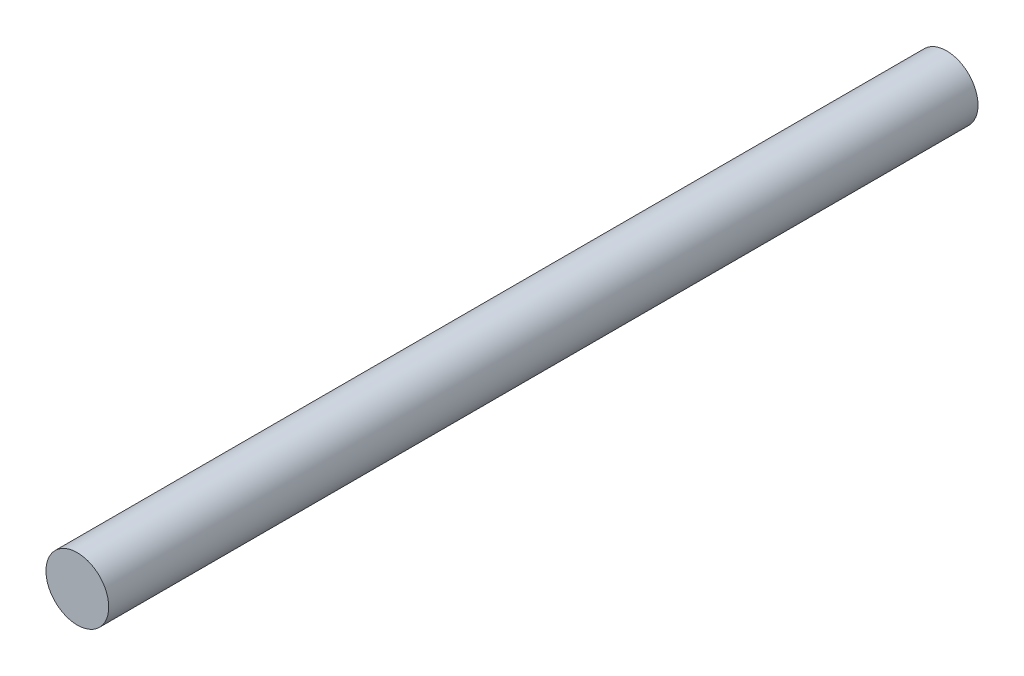
ISO-10303-21;
HEADER;
FILE_DESCRIPTION(('STEP AP214'),'2;1');
FILE_NAME('part.step','',(''),(''),'','','');
FILE_SCHEMA(('AUTOMOTIVE_DESIGN { 1 0 10303 214 1 1 1 1 }'));
ENDSEC;
DATA;
#1=APPLICATION_CONTEXT('core data for automotive mechanical design processes');
#2=APPLICATION_PROTOCOL_DEFINITION('international standard','automotive_design',2000,#1);
#3=PRODUCT_CONTEXT('',#1,'mechanical');
#4=PRODUCT('Part','Part','',(#3));
#5=PRODUCT_RELATED_PRODUCT_CATEGORY('part','',(#4));
#6=PRODUCT_DEFINITION_FORMATION('','',#4);
#7=PRODUCT_DEFINITION_CONTEXT('part definition',#1,'design');
#8=PRODUCT_DEFINITION('design','',#6,#7);
#9=PRODUCT_DEFINITION_SHAPE('','',#8);
#10=(LENGTH_UNIT() NAMED_UNIT(*) SI_UNIT(.MILLI.,.METRE.));
#11=(NAMED_UNIT(*) PLANE_ANGLE_UNIT() SI_UNIT($,.RADIAN.));
#12=(NAMED_UNIT(*) SI_UNIT($,.STERADIAN.) SOLID_ANGLE_UNIT());
#13=UNCERTAINTY_MEASURE_WITH_UNIT(LENGTH_MEASURE(1.E-05),#10,'distance_accuracy_value','');
#14=(GEOMETRIC_REPRESENTATION_CONTEXT(3) GLOBAL_UNCERTAINTY_ASSIGNED_CONTEXT((#13)) GLOBAL_UNIT_ASSIGNED_CONTEXT((#10,
#11,#12)) REPRESENTATION_CONTEXT('',''));
#15=CARTESIAN_POINT('',(0.,0.,0.));
#16=DIRECTION('',(0.,0.,1.));
#17=DIRECTION('',(1.,0.,0.));
#18=AXIS2_PLACEMENT_3D('',#15,#16,#17);
#19=CARTESIAN_POINT('',(0.,0.,9.));
#20=DIRECTION('',(0.,0.,-1.));
#21=DIRECTION('',(-1.,0.,0.));
#22=AXIS2_PLACEMENT_3D('',#19,#20,#21);
#23=CYLINDRICAL_SURFACE('',#22,0.325);
#24=CARTESIAN_POINT('',(0.,0.,9.));
#25=DIRECTION('',(0.,0.,1.));
#26=DIRECTION('',(1.,0.,0.));
#27=AXIS2_PLACEMENT_3D('',#24,#25,#26);
#28=CIRCLE('',#27,0.325);
#29=CARTESIAN_POINT('',(0.325,0.,9.));
#30=VERTEX_POINT('',#29);
#31=EDGE_CURVE('E10',#30,#30,#28,.T.);
#32=ORIENTED_EDGE('',*,*,#31,.F.);
#33=EDGE_LOOP('',(#32));
#34=FACE_BOUND('',#33,.T.);
#35=CARTESIAN_POINT('',(0.,0.,0.));
#36=DIRECTION('',(0.,0.,1.));
#37=DIRECTION('',(1.,0.,0.));
#38=AXIS2_PLACEMENT_3D('',#35,#36,#37);
#39=CIRCLE('',#38,0.325);
#40=CARTESIAN_POINT('',(0.325,0.,0.));
#41=VERTEX_POINT('',#40);
#42=EDGE_CURVE('E38',#41,#41,#39,.T.);
#43=ORIENTED_EDGE('',*,*,#42,.T.);
#44=EDGE_LOOP('',(#43));
#45=FACE_BOUND('',#44,.T.);
#46=ADVANCED_FACE('F35',(#34,#45),#23,.T.);
#47=CARTESIAN_POINT('',(0.,0.,9.));
#48=DIRECTION('',(0.,0.,1.));
#49=DIRECTION('',(1.,0.,0.));
#50=AXIS2_PLACEMENT_3D('',#47,#48,#49);
#51=PLANE('',#50);
#52=ORIENTED_EDGE('',*,*,#31,.T.);
#53=EDGE_LOOP('',(#52));
#54=FACE_BOUND('',#53,.T.);
#55=ADVANCED_FACE('F50',(#54),#51,.T.);
#56=CARTESIAN_POINT('',(0.,0.,0.));
#57=DIRECTION('',(0.,0.,1.));
#58=DIRECTION('',(1.,0.,0.));
#59=AXIS2_PLACEMENT_3D('',#56,#57,#58);
#60=PLANE('',#59);
#61=ORIENTED_EDGE('',*,*,#42,.F.);
#62=EDGE_LOOP('',(#61));
#63=FACE_BOUND('',#62,.T.);
#64=ADVANCED_FACE('F48',(#63),#60,.F.);
#65=CLOSED_SHELL('',(#46,#55,#64));
#66=MANIFOLD_SOLID_BREP('B2',#65);
#67=ADVANCED_BREP_SHAPE_REPRESENTATION('',(#18,#66),#14);
#68=SHAPE_DEFINITION_REPRESENTATION(#9,#67);
ENDSEC;
END-ISO-10303-21;
